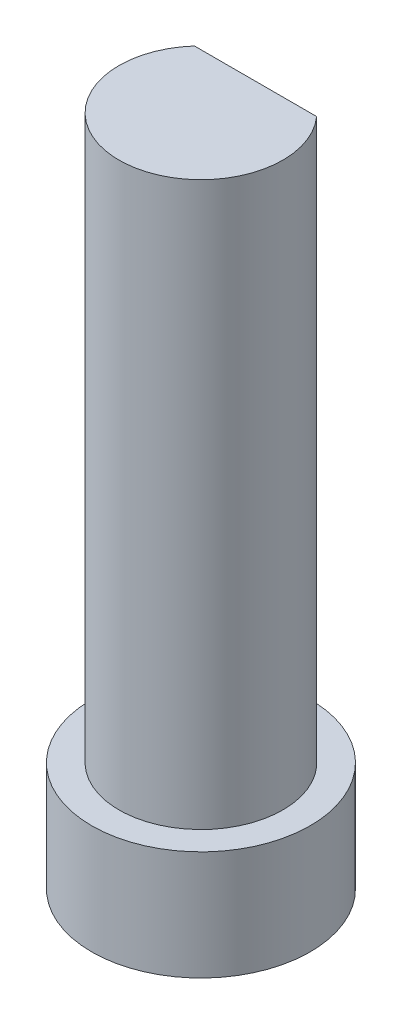
ISO-10303-21;
HEADER;
FILE_DESCRIPTION(('STEP AP214'),'2;1');
FILE_NAME('part.step','',(''),(''),'','','');
FILE_SCHEMA(('AUTOMOTIVE_DESIGN { 1 0 10303 214 1 1 1 1 }'));
ENDSEC;
DATA;
#1=APPLICATION_CONTEXT('core data for automotive mechanical design processes');
#2=APPLICATION_PROTOCOL_DEFINITION('international standard','automotive_design',2000,#1);
#3=PRODUCT_CONTEXT('',#1,'mechanical');
#4=PRODUCT('Part','Part','',(#3));
#5=PRODUCT_RELATED_PRODUCT_CATEGORY('part','',(#4));
#6=PRODUCT_DEFINITION_FORMATION('','',#4);
#7=PRODUCT_DEFINITION_CONTEXT('part definition',#1,'design');
#8=PRODUCT_DEFINITION('design','',#6,#7);
#9=PRODUCT_DEFINITION_SHAPE('','',#8);
#10=(LENGTH_UNIT() NAMED_UNIT(*) SI_UNIT(.MILLI.,.METRE.));
#11=(NAMED_UNIT(*) PLANE_ANGLE_UNIT() SI_UNIT($,.RADIAN.));
#12=(NAMED_UNIT(*) SI_UNIT($,.STERADIAN.) SOLID_ANGLE_UNIT());
#13=UNCERTAINTY_MEASURE_WITH_UNIT(LENGTH_MEASURE(1.E-05),#10,'distance_accuracy_value','');
#14=(GEOMETRIC_REPRESENTATION_CONTEXT(3) GLOBAL_UNCERTAINTY_ASSIGNED_CONTEXT((#13)) GLOBAL_UNIT_ASSIGNED_CONTEXT((#10,
#11,#12)) REPRESENTATION_CONTEXT('',''));
#15=CARTESIAN_POINT('',(0.,0.,0.));
#16=DIRECTION('',(0.,0.,1.));
#17=DIRECTION('',(1.,0.,0.));
#18=AXIS2_PLACEMENT_3D('',#15,#16,#17);
#19=CARTESIAN_POINT('',(0.,12.3,0.));
#20=DIRECTION('',(0.,-1.,0.));
#21=DIRECTION('',(0.,0.,-1.));
#22=AXIS2_PLACEMENT_3D('',#19,#20,#21);
#23=CYLINDRICAL_SURFACE('',#22,1.5);
#24=CARTESIAN_POINT('',(0.,12.3,0.));
#25=DIRECTION('',(0.,1.,0.));
#26=DIRECTION('',(0.,0.,1.));
#27=AXIS2_PLACEMENT_3D('',#24,#25,#26);
#28=CIRCLE('',#27,1.5);
#29=CARTESIAN_POINT('',(-1.1180339887499,12.3,-1.));
#30=VERTEX_POINT('',#29);
#31=CARTESIAN_POINT('',(1.1180339887499,12.3,-1.));
#32=VERTEX_POINT('',#31);
#33=EDGE_CURVE('E12',#30,#32,#28,.T.);
#34=ORIENTED_EDGE('',*,*,#33,.F.);
#35=DIRECTION('',(0.,1.,0.));
#36=VECTOR('',#35,1.);
#37=CARTESIAN_POINT('',(-1.1180339887499,2.,-1.));
#38=LINE('',#37,#36);
#39=CARTESIAN_POINT('',(-1.1180339887499,2.,-1.));
#40=VERTEX_POINT('',#39);
#41=EDGE_CURVE('E69',#40,#30,#38,.T.);
#42=ORIENTED_EDGE('',*,*,#41,.F.);
#43=CARTESIAN_POINT('',(0.,2.,0.));
#44=DIRECTION('',(0.,1.,0.));
#45=DIRECTION('',(0.,0.,1.));
#46=AXIS2_PLACEMENT_3D('',#43,#44,#45);
#47=CIRCLE('',#46,1.5);
#48=CARTESIAN_POINT('',(1.1180339887499,2.,-1.));
#49=VERTEX_POINT('',#48);
#50=EDGE_CURVE('E46',#40,#49,#47,.T.);
#51=ORIENTED_EDGE('',*,*,#50,.T.);
#52=DIRECTION('',(0.,1.,0.));
#53=VECTOR('',#52,1.);
#54=CARTESIAN_POINT('',(1.1180339887499,2.,-1.));
#55=LINE('',#54,#53);
#56=EDGE_CURVE('E57',#49,#32,#55,.T.);
#57=ORIENTED_EDGE('',*,*,#56,.T.);
#58=EDGE_LOOP('',(#34,#42,#51,#57));
#59=FACE_BOUND('',#58,.T.);
#60=ADVANCED_FACE('F43',(#59),#23,.T.);
#61=CARTESIAN_POINT('',(0.,12.3,0.));
#62=DIRECTION('',(0.,1.,0.));
#63=DIRECTION('',(0.,0.,1.));
#64=AXIS2_PLACEMENT_3D('',#61,#62,#63);
#65=PLANE('',#64);
#66=DIRECTION('',(1.,0.,0.));
#67=VECTOR('',#66,1.);
#68=CARTESIAN_POINT('',(0.,12.3,-1.));
#69=LINE('',#68,#67);
#70=EDGE_CURVE('E67',#30,#32,#69,.T.);
#71=ORIENTED_EDGE('',*,*,#70,.F.);
#72=ORIENTED_EDGE('',*,*,#33,.T.);
#73=EDGE_LOOP('',(#71,#72));
#74=FACE_BOUND('',#73,.T.);
#75=ADVANCED_FACE('F77',(#74),#65,.T.);
#76=CARTESIAN_POINT('',(0.,2.,0.));
#77=DIRECTION('',(0.,1.,0.));
#78=DIRECTION('',(0.,0.,1.));
#79=AXIS2_PLACEMENT_3D('',#76,#77,#78);
#80=PLANE('',#79);
#81=ORIENTED_EDGE('',*,*,#50,.F.);
#82=DIRECTION('',(1.,0.,0.));
#83=VECTOR('',#82,1.);
#84=CARTESIAN_POINT('',(0.,2.,-1.));
#85=LINE('',#84,#83);
#86=EDGE_CURVE('E62',#40,#49,#85,.T.);
#87=ORIENTED_EDGE('',*,*,#86,.T.);
#88=EDGE_LOOP('',(#81,#87));
#89=FACE_BOUND('',#88,.T.);
#90=ADVANCED_FACE('F79',(#89),#80,.F.);
#91=CARTESIAN_POINT('',(0.,2.,-1.));
#92=DIRECTION('',(0.,0.,1.));
#93=DIRECTION('',(1.,0.,0.));
#94=AXIS2_PLACEMENT_3D('',#91,#92,#93);
#95=PLANE('',#94);
#96=ORIENTED_EDGE('',*,*,#70,.T.);
#97=ORIENTED_EDGE('',*,*,#56,.F.);
#98=ORIENTED_EDGE('',*,*,#86,.F.);
#99=ORIENTED_EDGE('',*,*,#41,.T.);
#100=EDGE_LOOP('',(#96,#97,#98,#99));
#101=FACE_BOUND('',#100,.T.);
#102=ADVANCED_FACE('F68',(#101),#95,.F.);
#103=CLOSED_SHELL('',(#60,#75,#90,#102));
#104=MANIFOLD_SOLID_BREP('B2',#103);
#105=CARTESIAN_POINT('',(0.,2.,0.));
#106=DIRECTION('',(0.,-1.,0.));
#107=DIRECTION('',(0.,0.,-1.));
#108=AXIS2_PLACEMENT_3D('',#105,#106,#107);
#109=CYLINDRICAL_SURFACE('',#108,2.);
#110=CARTESIAN_POINT('',(0.,2.,0.));
#111=DIRECTION('',(0.,1.,0.));
#112=DIRECTION('',(0.,0.,1.));
#113=AXIS2_PLACEMENT_3D('',#110,#111,#112);
#114=CIRCLE('',#113,2.);
#115=CARTESIAN_POINT('',(0.,2.,2.));
#116=VERTEX_POINT('',#115);
#117=EDGE_CURVE('E42',#116,#116,#114,.T.);
#118=ORIENTED_EDGE('',*,*,#117,.F.);
#119=EDGE_LOOP('',(#118));
#120=FACE_BOUND('',#119,.T.);
#121=CARTESIAN_POINT('',(0.,0.,0.));
#122=DIRECTION('',(0.,1.,0.));
#123=DIRECTION('',(0.,0.,1.));
#124=AXIS2_PLACEMENT_3D('',#121,#122,#123);
#125=CIRCLE('',#124,2.);
#126=CARTESIAN_POINT('',(0.,0.,2.));
#127=VERTEX_POINT('',#126);
#128=EDGE_CURVE('E121',#127,#127,#125,.T.);
#129=ORIENTED_EDGE('',*,*,#128,.T.);
#130=EDGE_LOOP('',(#129));
#131=FACE_BOUND('',#130,.T.);
#132=ADVANCED_FACE('F118',(#120,#131),#109,.T.);
#133=CARTESIAN_POINT('',(0.,2.,0.));
#134=DIRECTION('',(0.,1.,0.));
#135=DIRECTION('',(0.,0.,1.));
#136=AXIS2_PLACEMENT_3D('',#133,#134,#135);
#137=PLANE('',#136);
#138=CARTESIAN_POINT('',(0.,2.,0.));
#139=DIRECTION('',(0.,-1.,0.));
#140=DIRECTION('',(0.,0.,-1.));
#141=AXIS2_PLACEMENT_3D('',#138,#139,#140);
#142=CIRCLE('',#141,0.2);
#143=CARTESIAN_POINT('',(0.,2.,-0.2));
#144=VERTEX_POINT('',#143);
#145=EDGE_CURVE('E128',#144,#144,#142,.T.);
#146=ORIENTED_EDGE('',*,*,#145,.T.);
#147=EDGE_LOOP('',(#146));
#148=FACE_BOUND('',#147,.T.);
#149=ORIENTED_EDGE('',*,*,#117,.T.);
#150=EDGE_LOOP('',(#149));
#151=FACE_BOUND('',#150,.T.);
#152=ADVANCED_FACE('F136',(#148,#151),#137,.T.);
#153=CARTESIAN_POINT('',(0.,0.,0.));
#154=DIRECTION('',(0.,1.,0.));
#155=DIRECTION('',(0.,0.,1.));
#156=AXIS2_PLACEMENT_3D('',#153,#154,#155);
#157=PLANE('',#156);
#158=CARTESIAN_POINT('',(0.,0.,0.));
#159=DIRECTION('',(0.,-1.,0.));
#160=DIRECTION('',(0.,0.,-1.));
#161=AXIS2_PLACEMENT_3D('',#158,#159,#160);
#162=CIRCLE('',#161,0.2);
#163=CARTESIAN_POINT('',(0.,0.,-0.2));
#164=VERTEX_POINT('',#163);
#165=EDGE_CURVE('E130',#164,#164,#162,.T.);
#166=ORIENTED_EDGE('',*,*,#165,.F.);
#167=EDGE_LOOP('',(#166));
#168=FACE_BOUND('',#167,.T.);
#169=ORIENTED_EDGE('',*,*,#128,.F.);
#170=EDGE_LOOP('',(#169));
#171=FACE_BOUND('',#170,.T.);
#172=ADVANCED_FACE('F141',(#168,#171),#157,.F.);
#173=CARTESIAN_POINT('',(0.,2.,0.));
#174=DIRECTION('',(0.,-1.,0.));
#175=DIRECTION('',(0.,0.,-1.));
#176=AXIS2_PLACEMENT_3D('',#173,#174,#175);
#177=CYLINDRICAL_SURFACE('',#176,0.2);
#178=ORIENTED_EDGE('',*,*,#145,.F.);
#179=EDGE_LOOP('',(#178));
#180=FACE_BOUND('',#179,.T.);
#181=ORIENTED_EDGE('',*,*,#165,.T.);
#182=EDGE_LOOP('',(#181));
#183=FACE_BOUND('',#182,.T.);
#184=ADVANCED_FACE('F138',(#180,#183),#177,.F.);
#185=CLOSED_SHELL('',(#132,#152,#172,#184));
#186=MANIFOLD_SOLID_BREP('B6',#185);
#187=ADVANCED_BREP_SHAPE_REPRESENTATION('',(#18,#104,#186),#14);
#188=SHAPE_DEFINITION_REPRESENTATION(#9,#187);
ENDSEC;
END-ISO-10303-21;
